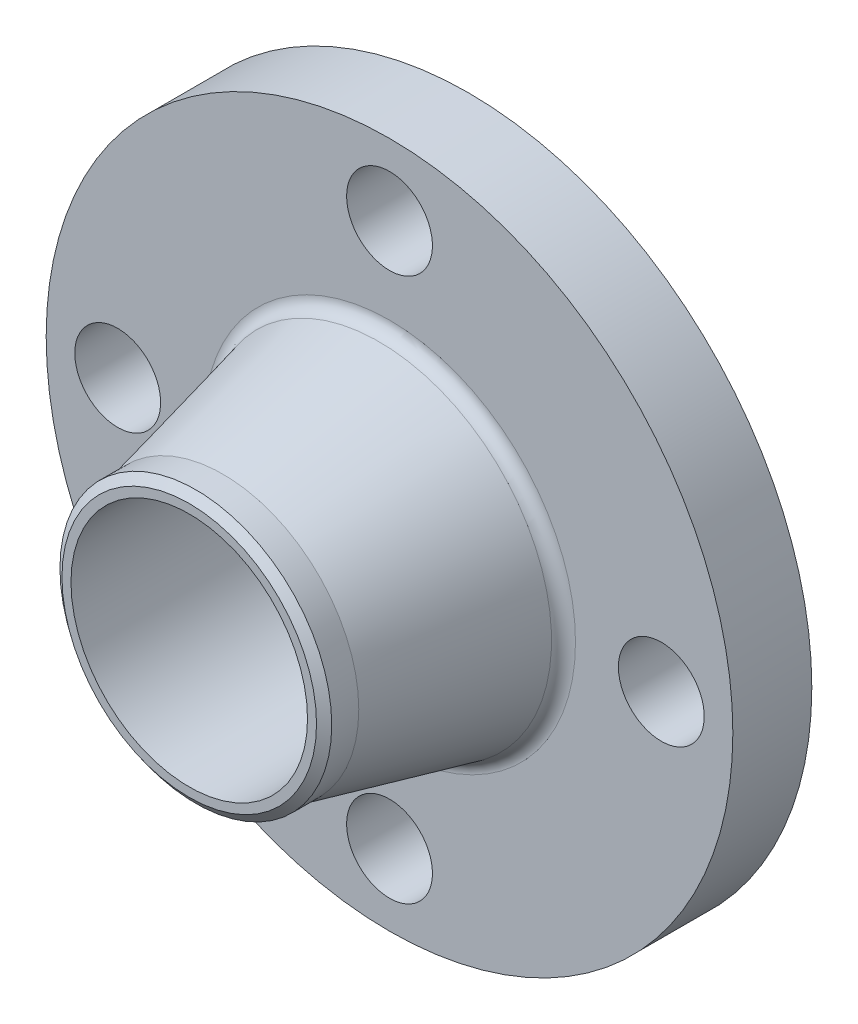
ISO-10303-21;
HEADER;
FILE_DESCRIPTION(('STEP AP214'),'2;1');
FILE_NAME('part.step','',(''),(''),'','','');
FILE_SCHEMA(('AUTOMOTIVE_DESIGN { 1 0 10303 214 1 1 1 1 }'));
ENDSEC;
DATA;
#1=APPLICATION_CONTEXT('core data for automotive mechanical design processes');
#2=APPLICATION_PROTOCOL_DEFINITION('international standard','automotive_design',2000,#1);
#3=PRODUCT_CONTEXT('',#1,'mechanical');
#4=PRODUCT('Part','Part','',(#3));
#5=PRODUCT_RELATED_PRODUCT_CATEGORY('part','',(#4));
#6=PRODUCT_DEFINITION_FORMATION('','',#4);
#7=PRODUCT_DEFINITION_CONTEXT('part definition',#1,'design');
#8=PRODUCT_DEFINITION('design','',#6,#7);
#9=PRODUCT_DEFINITION_SHAPE('','',#8);
#10=(LENGTH_UNIT() NAMED_UNIT(*) SI_UNIT(.MILLI.,.METRE.));
#11=(NAMED_UNIT(*) PLANE_ANGLE_UNIT() SI_UNIT($,.RADIAN.));
#12=(NAMED_UNIT(*) SI_UNIT($,.STERADIAN.) SOLID_ANGLE_UNIT());
#13=UNCERTAINTY_MEASURE_WITH_UNIT(LENGTH_MEASURE(1.E-05),#10,'distance_accuracy_value','');
#14=(GEOMETRIC_REPRESENTATION_CONTEXT(3) GLOBAL_UNCERTAINTY_ASSIGNED_CONTEXT((#13)) GLOBAL_UNIT_ASSIGNED_CONTEXT((#10,
#11,#12)) REPRESENTATION_CONTEXT('',''));
#15=CARTESIAN_POINT('',(0.,0.,0.));
#16=DIRECTION('',(0.,0.,1.));
#17=DIRECTION('',(1.,0.,0.));
#18=AXIS2_PLACEMENT_3D('',#15,#16,#17);
#19=CARTESIAN_POINT('',(60.325000000254,0.,17.4260000000766));
#20=DIRECTION('',(0.,0.,-1.));
#21=DIRECTION('',(0.877582561890188,-0.479425538604541,0.));
#22=AXIS2_PLACEMENT_3D('',#19,#20,#21);
#23=CYLINDRICAL_SURFACE('',#22,9.5250000000508);
#24=CARTESIAN_POINT('',(60.325000000254,0.,17.5260000000762));
#25=DIRECTION('',(0.,0.,-1.));
#26=DIRECTION('',(-1.,0.,0.));
#27=AXIS2_PLACEMENT_3D('',#24,#25,#26);
#28=CIRCLE('',#27,9.5250000000508);
#29=CARTESIAN_POINT('',(50.8000000002032,0.,17.5260000000762));
#30=VERTEX_POINT('',#29);
#31=EDGE_CURVE('E133',#30,#30,#28,.T.);
#32=ORIENTED_EDGE('',*,*,#31,.F.);
#33=EDGE_LOOP('',(#32));
#34=FACE_BOUND('',#33,.T.);
#35=CARTESIAN_POINT('',(60.325000000254,0.,0.));
#36=DIRECTION('',(0.,0.,-1.));
#37=DIRECTION('',(-1.,0.,0.));
#38=AXIS2_PLACEMENT_3D('',#35,#36,#37);
#39=CIRCLE('',#38,9.5250000000508);
#40=CARTESIAN_POINT('',(50.8000000002032,0.,0.));
#41=VERTEX_POINT('',#40);
#42=EDGE_CURVE('E364',#41,#41,#39,.T.);
#43=ORIENTED_EDGE('',*,*,#42,.T.);
#44=EDGE_LOOP('',(#43));
#45=FACE_BOUND('',#44,.T.);
#46=ADVANCED_FACE('F14',(#34,#45),#23,.F.);
#47=CARTESIAN_POINT('',(0.,0.,30.19425));
#48=DIRECTION('',(0.,0.,-1.));
#49=DIRECTION('',(0.479425538604541,0.877582561890188,0.));
#50=AXIS2_PLACEMENT_3D('',#47,#48,#49);
#51=CYLINDRICAL_SURFACE('',#50,76.200000000254);
#52=CARTESIAN_POINT('',(0.,0.,17.5260000000762));
#53=DIRECTION('',(0.,0.,-1.));
#54=DIRECTION('',(-1.,0.,0.));
#55=AXIS2_PLACEMENT_3D('',#52,#53,#54);
#56=CIRCLE('',#55,76.200000000254);
#57=CARTESIAN_POINT('',(-76.200000000254,0.,17.5260000000762));
#58=VERTEX_POINT('',#57);
#59=EDGE_CURVE('E129',#58,#58,#56,.T.);
#60=ORIENTED_EDGE('',*,*,#59,.T.);
#61=EDGE_LOOP('',(#60));
#62=FACE_BOUND('',#61,.T.);
#63=CARTESIAN_POINT('',(0.,0.,0.));
#64=DIRECTION('',(0.,0.,-1.));
#65=DIRECTION('',(-1.,0.,0.));
#66=AXIS2_PLACEMENT_3D('',#63,#64,#65);
#67=CIRCLE('',#66,76.200000000254);
#68=CARTESIAN_POINT('',(-76.200000000254,0.,0.));
#69=VERTEX_POINT('',#68);
#70=EDGE_CURVE('E18',#69,#69,#67,.T.);
#71=ORIENTED_EDGE('',*,*,#70,.F.);
#72=EDGE_LOOP('',(#71));
#73=FACE_BOUND('',#72,.T.);
#74=ADVANCED_FACE('F168',(#62,#73),#51,.T.);
#75=CARTESIAN_POINT('',(0.,0.,20.5740000000762));
#76=DIRECTION('',(0.,0.,-1.));
#77=DIRECTION('',(-0.479425538604541,-0.877582561890188,0.));
#78=AXIS2_PLACEMENT_3D('',#75,#76,#77);
#79=TOROIDAL_SURFACE('',#78,41.276214716138,3.048);
#80=CARTESIAN_POINT('',(0.,0.,17.5260000000762));
#81=DIRECTION('',(0.,0.,-1.));
#82=DIRECTION('',(-1.,0.,0.));
#83=AXIS2_PLACEMENT_3D('',#80,#81,#82);
#84=CIRCLE('',#83,41.276214716138);
#85=CARTESIAN_POINT('',(-41.276214716138,0.,17.5260000000762));
#86=VERTEX_POINT('',#85);
#87=EDGE_CURVE('E138',#86,#86,#84,.T.);
#88=ORIENTED_EDGE('',*,*,#87,.F.);
#89=EDGE_LOOP('',(#88));
#90=FACE_BOUND('',#89,.T.);
#91=CARTESIAN_POINT('',(0.,0.,19.876072391921));
#92=DIRECTION('',(0.,0.,-1.));
#93=DIRECTION('',(-1.,0.,0.));
#94=AXIS2_PLACEMENT_3D('',#91,#92,#93);
#95=CIRCLE('',#94,38.309195832814);
#96=CARTESIAN_POINT('',(-38.309195832814,0.,19.876072391921));
#97=VERTEX_POINT('',#96);
#98=EDGE_CURVE('E9',#97,#97,#95,.T.);
#99=ORIENTED_EDGE('',*,*,#98,.T.);
#100=EDGE_LOOP('',(#99));
#101=FACE_BOUND('',#100,.T.);
#102=ADVANCED_FACE('F164',(#90,#101),#79,.F.);
#103=CARTESIAN_POINT('',(0.,0.,54.509177729966));
#104=DIRECTION('',(0.,0.,-1.));
#105=DIRECTION('',(-0.479425538604541,-0.877582561890188,0.));
#106=AXIS2_PLACEMENT_3D('',#103,#104,#105);
#107=CONICAL_SURFACE('',#106,30.1625,0.231028556913);
#108=CARTESIAN_POINT('',(0.,0.,54.509177729966));
#109=DIRECTION('',(0.,0.,-1.));
#110=DIRECTION('',(-1.,0.,0.));
#111=AXIS2_PLACEMENT_3D('',#108,#109,#110);
#112=CIRCLE('',#111,30.1625);
#113=CARTESIAN_POINT('',(-30.1625,0.,54.509177729966));
#114=VERTEX_POINT('',#113);
#115=EDGE_CURVE('E25',#114,#114,#112,.T.);
#116=ORIENTED_EDGE('',*,*,#115,.T.);
#117=EDGE_LOOP('',(#116));
#118=FACE_BOUND('',#117,.T.);
#119=ORIENTED_EDGE('',*,*,#98,.F.);
#120=EDGE_LOOP('',(#119));
#121=FACE_BOUND('',#120,.T.);
#122=ADVANCED_FACE('F152',(#118,#121),#107,.T.);
#123=CARTESIAN_POINT('',(0.,0.,30.19425));
#124=DIRECTION('',(0.,0.,-1.));
#125=DIRECTION('',(-0.479425538604541,-0.877582561890188,0.));
#126=AXIS2_PLACEMENT_3D('',#123,#124,#125);
#127=CYLINDRICAL_SURFACE('',#126,30.1625);
#128=CARTESIAN_POINT('',(0.,0.,60.509177729942));
#129=DIRECTION('',(0.,0.,-1.));
#130=DIRECTION('',(-1.,0.,0.));
#131=AXIS2_PLACEMENT_3D('',#128,#129,#130);
#132=CIRCLE('',#131,30.1625);
#133=CARTESIAN_POINT('',(-30.1625,0.,60.509177729942));
#134=VERTEX_POINT('',#133);
#135=EDGE_CURVE('E122',#134,#134,#132,.T.);
#136=ORIENTED_EDGE('',*,*,#135,.T.);
#137=EDGE_LOOP('',(#136));
#138=FACE_BOUND('',#137,.T.);
#139=ORIENTED_EDGE('',*,*,#115,.F.);
#140=EDGE_LOOP('',(#139));
#141=FACE_BOUND('',#140,.T.);
#142=ADVANCED_FACE('F155',(#138,#141),#127,.T.);
#143=CARTESIAN_POINT('',(0.,0.,61.976000000254));
#144=DIRECTION('',(0.,0.,-1.));
#145=DIRECTION('',(-0.479425538604541,0.877582561890188,0.));
#146=AXIS2_PLACEMENT_3D('',#143,#144,#145);
#147=CONICAL_SURFACE('',#146,28.250899999992,0.916297857297);
#148=CARTESIAN_POINT('',(0.,0.,61.976000000254));
#149=DIRECTION('',(0.,0.,-1.));
#150=DIRECTION('',(-1.,0.,0.));
#151=AXIS2_PLACEMENT_3D('',#148,#149,#150);
#152=CIRCLE('',#151,28.250899999992);
#153=CARTESIAN_POINT('',(-28.250899999992,0.,61.976000000254));
#154=VERTEX_POINT('',#153);
#155=EDGE_CURVE('E110',#154,#154,#152,.T.);
#156=ORIENTED_EDGE('',*,*,#155,.T.);
#157=EDGE_LOOP('',(#156));
#158=FACE_BOUND('',#157,.T.);
#159=ORIENTED_EDGE('',*,*,#135,.F.);
#160=EDGE_LOOP('',(#159));
#161=FACE_BOUND('',#160,.T.);
#162=ADVANCED_FACE('F111',(#158,#161),#147,.T.);
#163=CARTESIAN_POINT('',(0.,0.,30.19425));
#164=DIRECTION('',(0.,0.,-1.));
#165=DIRECTION('',(-0.479425538604541,-0.877582561890188,0.));
#166=AXIS2_PLACEMENT_3D('',#163,#164,#165);
#167=CYLINDRICAL_SURFACE('',#166,26.2509);
#168=CARTESIAN_POINT('',(0.,0.,61.976000000254));
#169=DIRECTION('',(0.,0.,-1.));
#170=DIRECTION('',(-1.,0.,0.));
#171=AXIS2_PLACEMENT_3D('',#168,#169,#170);
#172=CIRCLE('',#171,26.2509);
#173=CARTESIAN_POINT('',(-26.2509,0.,61.976000000254));
#174=VERTEX_POINT('',#173);
#175=EDGE_CURVE('E115',#174,#174,#172,.T.);
#176=ORIENTED_EDGE('',*,*,#175,.F.);
#177=EDGE_LOOP('',(#176));
#178=FACE_BOUND('',#177,.T.);
#179=CARTESIAN_POINT('',(0.,0.,-1.58750000000762));
#180=DIRECTION('',(0.,0.,-1.));
#181=DIRECTION('',(-1.,0.,0.));
#182=AXIS2_PLACEMENT_3D('',#179,#180,#181);
#183=CIRCLE('',#182,26.2509);
#184=CARTESIAN_POINT('',(-26.2509,0.,-1.58750000000762));
#185=VERTEX_POINT('',#184);
#186=EDGE_CURVE('E103',#185,#185,#183,.T.);
#187=ORIENTED_EDGE('',*,*,#186,.T.);
#188=EDGE_LOOP('',(#187));
#189=FACE_BOUND('',#188,.T.);
#190=ADVANCED_FACE('F16',(#178,#189),#167,.F.);
#191=CARTESIAN_POINT('',(0.,26.2509,-1.58750000000762));
#192=DIRECTION('',(0.,0.,-1.));
#193=DIRECTION('',(0.,-1.,0.));
#194=AXIS2_PLACEMENT_3D('',#191,#192,#193);
#195=PLANE('',#194);
#196=CARTESIAN_POINT('',(0.,0.,-1.58750000000762));
#197=DIRECTION('',(0.,0.,-1.));
#198=DIRECTION('',(-1.,0.,0.));
#199=AXIS2_PLACEMENT_3D('',#196,#197,#198);
#200=CIRCLE('',#199,45.974000000254);
#201=CARTESIAN_POINT('',(-45.974000000254,0.,-1.58750000000762));
#202=VERTEX_POINT('',#201);
#203=EDGE_CURVE('E124',#202,#202,#200,.T.);
#204=ORIENTED_EDGE('',*,*,#203,.T.);
#205=EDGE_LOOP('',(#204));
#206=FACE_BOUND('',#205,.T.);
#207=ORIENTED_EDGE('',*,*,#186,.F.);
#208=EDGE_LOOP('',(#207));
#209=FACE_BOUND('',#208,.T.);
#210=ADVANCED_FACE('F184',(#206,#209),#195,.T.);
#211=CARTESIAN_POINT('',(0.,30.1625,61.976000000254));
#212=DIRECTION('',(0.,0.,-1.));
#213=DIRECTION('',(0.,-1.,0.));
#214=AXIS2_PLACEMENT_3D('',#211,#212,#213);
#215=PLANE('',#214);
#216=ORIENTED_EDGE('',*,*,#155,.F.);
#217=EDGE_LOOP('',(#216));
#218=FACE_BOUND('',#217,.T.);
#219=ORIENTED_EDGE('',*,*,#175,.T.);
#220=EDGE_LOOP('',(#219));
#221=FACE_BOUND('',#220,.T.);
#222=ADVANCED_FACE('F186',(#218,#221),#215,.F.);
#223=CARTESIAN_POINT('',(0.,0.,30.19425));
#224=DIRECTION('',(0.,0.,-1.));
#225=DIRECTION('',(0.479425538604541,0.877582561890188,0.));
#226=AXIS2_PLACEMENT_3D('',#223,#224,#225);
#227=CYLINDRICAL_SURFACE('',#226,45.974000000254);
#228=CARTESIAN_POINT('',(0.,0.,0.));
#229=DIRECTION('',(0.,0.,-1.));
#230=DIRECTION('',(-1.,0.,0.));
#231=AXIS2_PLACEMENT_3D('',#228,#229,#230);
#232=CIRCLE('',#231,45.974000000254);
#233=CARTESIAN_POINT('',(-45.974000000254,0.,0.));
#234=VERTEX_POINT('',#233);
#235=EDGE_CURVE('E373',#234,#234,#232,.T.);
#236=ORIENTED_EDGE('',*,*,#235,.T.);
#237=EDGE_LOOP('',(#236));
#238=FACE_BOUND('',#237,.T.);
#239=ORIENTED_EDGE('',*,*,#203,.F.);
#240=EDGE_LOOP('',(#239));
#241=FACE_BOUND('',#240,.T.);
#242=ADVANCED_FACE('F182',(#238,#241),#227,.T.);
#243=CARTESIAN_POINT('',(0.,45.974000000254,0.));
#244=DIRECTION('',(0.,0.,-1.));
#245=DIRECTION('',(0.,-1.,0.));
#246=AXIS2_PLACEMENT_3D('',#243,#244,#245);
#247=PLANE('',#246);
#248=ORIENTED_EDGE('',*,*,#70,.T.);
#249=EDGE_LOOP('',(#248));
#250=FACE_BOUND('',#249,.T.);
#251=ORIENTED_EDGE('',*,*,#42,.F.);
#252=EDGE_LOOP('',(#251));
#253=FACE_BOUND('',#252,.T.);
#254=ORIENTED_EDGE('',*,*,#235,.F.);
#255=EDGE_LOOP('',(#254));
#256=FACE_BOUND('',#255,.T.);
#257=CARTESIAN_POINT('',(0.,-60.325000000254,0.));
#258=DIRECTION('',(0.,0.,-1.));
#259=DIRECTION('',(-1.,0.,0.));
#260=AXIS2_PLACEMENT_3D('',#257,#258,#259);
#261=CIRCLE('',#260,9.5250000000508);
#262=CARTESIAN_POINT('',(-9.5250000000508,-60.325000000254,0.));
#263=VERTEX_POINT('',#262);
#264=EDGE_CURVE('E132',#263,#263,#261,.T.);
#265=ORIENTED_EDGE('',*,*,#264,.F.);
#266=EDGE_LOOP('',(#265));
#267=FACE_BOUND('',#266,.T.);
#268=CARTESIAN_POINT('',(-60.325000000254,0.,0.));
#269=DIRECTION('',(0.,0.,-1.));
#270=DIRECTION('',(-1.,0.,0.));
#271=AXIS2_PLACEMENT_3D('',#268,#269,#270);
#272=CIRCLE('',#271,9.5250000000254);
#273=CARTESIAN_POINT('',(-69.8500000002794,0.,0.));
#274=VERTEX_POINT('',#273);
#275=EDGE_CURVE('E141',#274,#274,#272,.T.);
#276=ORIENTED_EDGE('',*,*,#275,.F.);
#277=EDGE_LOOP('',(#276));
#278=FACE_BOUND('',#277,.T.);
#279=CARTESIAN_POINT('',(0.,60.325000000254,0.));
#280=DIRECTION('',(0.,0.,-1.));
#281=DIRECTION('',(-1.,0.,0.));
#282=AXIS2_PLACEMENT_3D('',#279,#280,#281);
#283=CIRCLE('',#282,9.5250000000508);
#284=CARTESIAN_POINT('',(-9.52500000005081,60.325000000254,0.));
#285=VERTEX_POINT('',#284);
#286=EDGE_CURVE('E381',#285,#285,#283,.T.);
#287=ORIENTED_EDGE('',*,*,#286,.F.);
#288=EDGE_LOOP('',(#287));
#289=FACE_BOUND('',#288,.T.);
#290=ADVANCED_FACE('F178',(#250,#253,#256,#267,#278,#289),#247,.T.);
#291=CARTESIAN_POINT('',(0.,60.325000000254,17.4260000000766));
#292=DIRECTION('',(0.,0.,-1.));
#293=DIRECTION('',(0.479425538604541,0.877582561890188,0.));
#294=AXIS2_PLACEMENT_3D('',#291,#292,#293);
#295=CYLINDRICAL_SURFACE('',#294,9.5250000000508);
#296=CARTESIAN_POINT('',(0.,60.325000000254,17.5260000000762));
#297=DIRECTION('',(0.,0.,-1.));
#298=DIRECTION('',(-1.,0.,0.));
#299=AXIS2_PLACEMENT_3D('',#296,#297,#298);
#300=CIRCLE('',#299,9.5250000000508);
#301=CARTESIAN_POINT('',(-9.52500000005081,60.325000000254,17.5260000000762));
#302=VERTEX_POINT('',#301);
#303=EDGE_CURVE('E146',#302,#302,#300,.T.);
#304=ORIENTED_EDGE('',*,*,#303,.F.);
#305=EDGE_LOOP('',(#304));
#306=FACE_BOUND('',#305,.T.);
#307=ORIENTED_EDGE('',*,*,#286,.T.);
#308=EDGE_LOOP('',(#307));
#309=FACE_BOUND('',#308,.T.);
#310=ADVANCED_FACE('F181',(#306,#309),#295,.F.);
#311=CARTESIAN_POINT('',(-60.325000000254,0.,17.4260000000766));
#312=DIRECTION('',(0.,0.,-1.));
#313=DIRECTION('',(-0.877582561890188,0.479425538604541,0.));
#314=AXIS2_PLACEMENT_3D('',#311,#312,#313);
#315=CYLINDRICAL_SURFACE('',#314,9.5250000000254);
#316=CARTESIAN_POINT('',(-60.325000000254,0.,17.5260000000762));
#317=DIRECTION('',(0.,0.,-1.));
#318=DIRECTION('',(-1.,0.,0.));
#319=AXIS2_PLACEMENT_3D('',#316,#317,#318);
#320=CIRCLE('',#319,9.5250000000254);
#321=CARTESIAN_POINT('',(-69.8500000002794,0.,17.5260000000762));
#322=VERTEX_POINT('',#321);
#323=EDGE_CURVE('E144',#322,#322,#320,.T.);
#324=ORIENTED_EDGE('',*,*,#323,.F.);
#325=EDGE_LOOP('',(#324));
#326=FACE_BOUND('',#325,.T.);
#327=ORIENTED_EDGE('',*,*,#275,.T.);
#328=EDGE_LOOP('',(#327));
#329=FACE_BOUND('',#328,.T.);
#330=ADVANCED_FACE('F189',(#326,#329),#315,.F.);
#331=CARTESIAN_POINT('',(0.,-60.325000000254,17.4260000000766));
#332=DIRECTION('',(0.,0.,-1.));
#333=DIRECTION('',(-0.479425538604541,-0.877582561890188,0.));
#334=AXIS2_PLACEMENT_3D('',#331,#332,#333);
#335=CYLINDRICAL_SURFACE('',#334,9.5250000000508);
#336=CARTESIAN_POINT('',(0.,-60.325000000254,17.5260000000762));
#337=DIRECTION('',(0.,0.,-1.));
#338=DIRECTION('',(-1.,0.,0.));
#339=AXIS2_PLACEMENT_3D('',#336,#337,#338);
#340=CIRCLE('',#339,9.5250000000508);
#341=CARTESIAN_POINT('',(-9.5250000000508,-60.325000000254,17.5260000000762));
#342=VERTEX_POINT('',#341);
#343=EDGE_CURVE('E128',#342,#342,#340,.T.);
#344=ORIENTED_EDGE('',*,*,#343,.F.);
#345=EDGE_LOOP('',(#344));
#346=FACE_BOUND('',#345,.T.);
#347=ORIENTED_EDGE('',*,*,#264,.T.);
#348=EDGE_LOOP('',(#347));
#349=FACE_BOUND('',#348,.T.);
#350=ADVANCED_FACE('F192',(#346,#349),#335,.F.);
#351=CARTESIAN_POINT('',(0.,76.200000000254,17.5260000000762));
#352=DIRECTION('',(0.,0.,-1.));
#353=DIRECTION('',(0.,-1.,0.));
#354=AXIS2_PLACEMENT_3D('',#351,#352,#353);
#355=PLANE('',#354);
#356=ORIENTED_EDGE('',*,*,#59,.F.);
#357=EDGE_LOOP('',(#356));
#358=FACE_BOUND('',#357,.T.);
#359=ORIENTED_EDGE('',*,*,#31,.T.);
#360=EDGE_LOOP('',(#359));
#361=FACE_BOUND('',#360,.T.);
#362=ORIENTED_EDGE('',*,*,#87,.T.);
#363=EDGE_LOOP('',(#362));
#364=FACE_BOUND('',#363,.T.);
#365=ORIENTED_EDGE('',*,*,#343,.T.);
#366=EDGE_LOOP('',(#365));
#367=FACE_BOUND('',#366,.T.);
#368=ORIENTED_EDGE('',*,*,#323,.T.);
#369=EDGE_LOOP('',(#368));
#370=FACE_BOUND('',#369,.T.);
#371=ORIENTED_EDGE('',*,*,#303,.T.);
#372=EDGE_LOOP('',(#371));
#373=FACE_BOUND('',#372,.T.);
#374=ADVANCED_FACE('F200',(#358,#361,#364,#367,#370,#373),#355,.F.);
#375=CLOSED_SHELL('',(#46,#74,#102,#122,#142,#162,#190,#210,#222,#242,#290,#310,#330,#350,#374));
#376=MANIFOLD_SOLID_BREP('B1',#375);
#377=ADVANCED_BREP_SHAPE_REPRESENTATION('',(#18,#376),#14);
#378=SHAPE_DEFINITION_REPRESENTATION(#9,#377);
ENDSEC;
END-ISO-10303-21;
